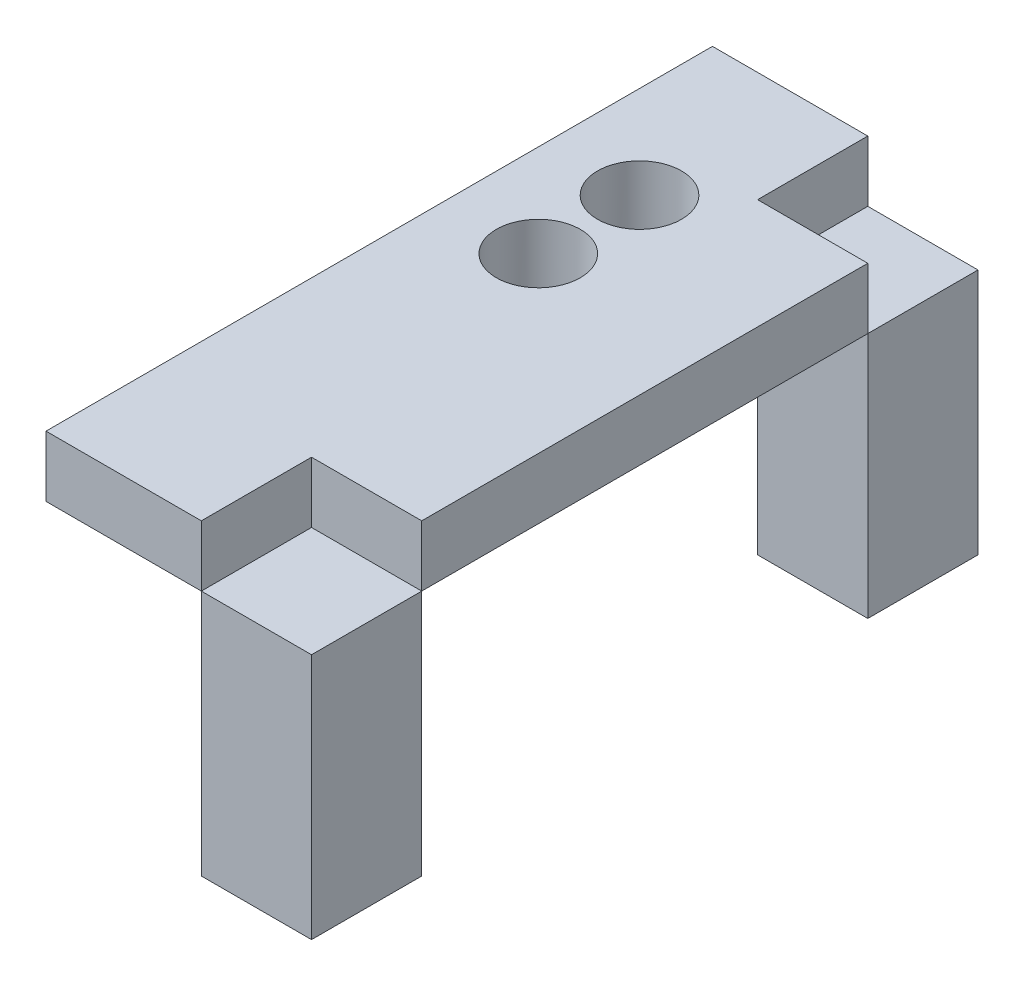
ISO-10303-21;
HEADER;
FILE_DESCRIPTION(('STEP AP214'),'2;1');
FILE_NAME('part.step','',(''),(''),'','','');
FILE_SCHEMA(('AUTOMOTIVE_DESIGN { 1 0 10303 214 1 1 1 1 }'));
ENDSEC;
DATA;
#1=APPLICATION_CONTEXT('core data for automotive mechanical design processes');
#2=APPLICATION_PROTOCOL_DEFINITION('international standard','automotive_design',2000,#1);
#3=PRODUCT_CONTEXT('',#1,'mechanical');
#4=PRODUCT('Part','Part','',(#3));
#5=PRODUCT_RELATED_PRODUCT_CATEGORY('part','',(#4));
#6=PRODUCT_DEFINITION_FORMATION('','',#4);
#7=PRODUCT_DEFINITION_CONTEXT('part definition',#1,'design');
#8=PRODUCT_DEFINITION('design','',#6,#7);
#9=PRODUCT_DEFINITION_SHAPE('','',#8);
#10=(LENGTH_UNIT() NAMED_UNIT(*) SI_UNIT(.MILLI.,.METRE.));
#11=(NAMED_UNIT(*) PLANE_ANGLE_UNIT() SI_UNIT($,.RADIAN.));
#12=(NAMED_UNIT(*) SI_UNIT($,.STERADIAN.) SOLID_ANGLE_UNIT());
#13=UNCERTAINTY_MEASURE_WITH_UNIT(LENGTH_MEASURE(1.E-05),#10,'distance_accuracy_value','');
#14=(GEOMETRIC_REPRESENTATION_CONTEXT(3) GLOBAL_UNCERTAINTY_ASSIGNED_CONTEXT((#13)) GLOBAL_UNIT_ASSIGNED_CONTEXT((#10,
#11,#12)) REPRESENTATION_CONTEXT('',''));
#15=CARTESIAN_POINT('',(0.,0.,0.));
#16=DIRECTION('',(0.,0.,1.));
#17=DIRECTION('',(1.,0.,0.));
#18=AXIS2_PLACEMENT_3D('',#15,#16,#17);
#19=CARTESIAN_POINT('',(-4.40000000014617,58.832258520887,7.35524959069381));
#20=DIRECTION('',(0.,0.,-1.));
#21=DIRECTION('',(0.,1.,0.));
#22=AXIS2_PLACEMENT_3D('',#19,#20,#21);
#23=PLANE('',#22);
#24=DIRECTION('',(-1.,0.,0.));
#25=VECTOR('',#24,1.);
#26=CARTESIAN_POINT('',(-4.40000000014592,24.6549999999976,7.35524959069391));
#27=LINE('',#26,#25);
#28=CARTESIAN_POINT('',(2.99999999999996,24.6549999999976,7.35524959069381));
#29=VERTEX_POINT('',#28);
#30=CARTESIAN_POINT('',(-4.40000000014617,24.6549999999976,7.35524959069381));
#31=VERTEX_POINT('',#30);
#32=EDGE_CURVE('E58',#29,#31,#27,.T.);
#33=ORIENTED_EDGE('',*,*,#32,.F.);
#34=DIRECTION('',(0.,-1.,0.));
#35=VECTOR('',#34,1.);
#36=CARTESIAN_POINT('',(2.99999999999996,58.832258520887,7.35524959069381));
#37=LINE('',#36,#35);
#38=CARTESIAN_POINT('',(2.99999999999996,21.7549999998925,7.35524959069392));
#39=VERTEX_POINT('',#38);
#40=EDGE_CURVE('E133',#29,#39,#37,.T.);
#41=ORIENTED_EDGE('',*,*,#40,.T.);
#42=DIRECTION('',(1.,0.,0.));
#43=VECTOR('',#42,1.);
#44=CARTESIAN_POINT('',(-4.40000000014617,21.7549999998925,7.35524959069392));
#45=LINE('',#44,#43);
#46=CARTESIAN_POINT('',(-4.40000000014617,21.7549999998925,7.35524959069392));
#47=VERTEX_POINT('',#46);
#48=EDGE_CURVE('E150',#47,#39,#45,.T.);
#49=ORIENTED_EDGE('',*,*,#48,.F.);
#50=DIRECTION('',(0.,-1.,0.));
#51=VECTOR('',#50,1.);
#52=CARTESIAN_POINT('',(-4.40000000014617,58.832258520887,7.35524959069381));
#53=LINE('',#52,#51);
#54=EDGE_CURVE('E119',#31,#47,#53,.T.);
#55=ORIENTED_EDGE('',*,*,#54,.F.);
#56=EDGE_LOOP('',(#33,#41,#49,#55));
#57=FACE_BOUND('',#56,.T.);
#58=ADVANCED_FACE('F50',(#57),#23,.T.);
#59=CARTESIAN_POINT('',(-4.40000000014639,58.8322585208871,39.1052495906938));
#60=DIRECTION('',(-1.,0.,0.));
#61=DIRECTION('',(0.,0.,1.));
#62=AXIS2_PLACEMENT_3D('',#59,#60,#61);
#63=PLANE('',#62);
#64=DIRECTION('',(0.,0.,1.));
#65=VECTOR('',#64,1.);
#66=CARTESIAN_POINT('',(-4.40000000014639,24.6549999999977,39.1052495906939));
#67=LINE('',#66,#65);
#68=CARTESIAN_POINT('',(-4.40000000014639,24.6549999999977,39.1052495906939));
#69=VERTEX_POINT('',#68);
#70=EDGE_CURVE('E96',#31,#69,#67,.T.);
#71=ORIENTED_EDGE('',*,*,#70,.F.);
#72=ORIENTED_EDGE('',*,*,#54,.T.);
#73=DIRECTION('',(0.,0.,-1.));
#74=VECTOR('',#73,1.);
#75=CARTESIAN_POINT('',(-4.40000000014639,21.7549999998926,39.1052495906939));
#76=LINE('',#75,#74);
#77=CARTESIAN_POINT('',(-4.40000000014639,21.7549999998926,39.1052495906939));
#78=VERTEX_POINT('',#77);
#79=EDGE_CURVE('E135',#78,#47,#76,.T.);
#80=ORIENTED_EDGE('',*,*,#79,.F.);
#81=DIRECTION('',(0.,-1.,0.));
#82=VECTOR('',#81,1.);
#83=CARTESIAN_POINT('',(-4.40000000014639,58.8322585208871,39.1052495906938));
#84=LINE('',#83,#82);
#85=EDGE_CURVE('E117',#69,#78,#84,.T.);
#86=ORIENTED_EDGE('',*,*,#85,.F.);
#87=EDGE_LOOP('',(#71,#72,#80,#86));
#88=FACE_BOUND('',#87,.T.);
#89=ADVANCED_FACE('F180',(#88),#63,.T.);
#90=CARTESIAN_POINT('',(2.99999999999996,58.8322585208871,39.1052495906938));
#91=DIRECTION('',(0.,0.,1.));
#92=DIRECTION('',(0.,-1.,0.));
#93=AXIS2_PLACEMENT_3D('',#90,#91,#92);
#94=PLANE('',#93);
#95=DIRECTION('',(1.,0.,0.));
#96=VECTOR('',#95,1.);
#97=CARTESIAN_POINT('',(3.0000000000002,24.6549999999977,39.1052495906939));
#98=LINE('',#97,#96);
#99=CARTESIAN_POINT('',(2.99999999999996,24.6549999999977,39.1052495906939));
#100=VERTEX_POINT('',#99);
#101=EDGE_CURVE('E92',#69,#100,#98,.T.);
#102=ORIENTED_EDGE('',*,*,#101,.F.);
#103=ORIENTED_EDGE('',*,*,#85,.T.);
#104=DIRECTION('',(-1.,0.,0.));
#105=VECTOR('',#104,1.);
#106=CARTESIAN_POINT('',(2.99999999999996,21.7549999998926,39.1052495906939));
#107=LINE('',#106,#105);
#108=CARTESIAN_POINT('',(2.99999999999996,21.7549999998926,39.1052495906939));
#109=VERTEX_POINT('',#108);
#110=EDGE_CURVE('E115',#109,#78,#107,.T.);
#111=ORIENTED_EDGE('',*,*,#110,.F.);
#112=DIRECTION('',(0.,-1.,0.));
#113=VECTOR('',#112,1.);
#114=CARTESIAN_POINT('',(2.99999999999996,58.8322585208871,39.1052495906938));
#115=LINE('',#114,#113);
#116=EDGE_CURVE('E108',#100,#109,#115,.T.);
#117=ORIENTED_EDGE('',*,*,#116,.F.);
#118=EDGE_LOOP('',(#102,#103,#111,#117));
#119=FACE_BOUND('',#118,.T.);
#120=ADVANCED_FACE('F113',(#119),#94,.T.);
#121=CARTESIAN_POINT('',(2.99999999999996,58.832258520887,33.8552495906938));
#122=DIRECTION('',(1.,0.,0.));
#123=DIRECTION('',(0.,0.,-1.));
#124=AXIS2_PLACEMENT_3D('',#121,#122,#123);
#125=PLANE('',#124);
#126=DIRECTION('',(0.,0.,-1.));
#127=VECTOR('',#126,1.);
#128=CARTESIAN_POINT('',(2.99999999999996,24.6549999999977,33.8552495906939));
#129=LINE('',#128,#127);
#130=CARTESIAN_POINT('',(2.99999999999996,24.6549999999977,33.8552495906939));
#131=VERTEX_POINT('',#130);
#132=EDGE_CURVE('E95',#100,#131,#129,.T.);
#133=ORIENTED_EDGE('',*,*,#132,.F.);
#134=ORIENTED_EDGE('',*,*,#116,.T.);
#135=DIRECTION('',(0.,0.,1.));
#136=VECTOR('',#135,1.);
#137=CARTESIAN_POINT('',(2.99999999999996,21.7549999998925,33.8552495906939));
#138=LINE('',#137,#136);
#139=CARTESIAN_POINT('',(2.99999999999996,21.7549999998925,33.8552495906939));
#140=VERTEX_POINT('',#139);
#141=EDGE_CURVE('E171',#140,#109,#138,.T.);
#142=ORIENTED_EDGE('',*,*,#141,.F.);
#143=DIRECTION('',(0.,-1.,0.));
#144=VECTOR('',#143,1.);
#145=CARTESIAN_POINT('',(2.99999999999996,58.832258520887,33.8552495906938));
#146=LINE('',#145,#144);
#147=EDGE_CURVE('E111',#131,#140,#146,.T.);
#148=ORIENTED_EDGE('',*,*,#147,.F.);
#149=EDGE_LOOP('',(#133,#134,#142,#148));
#150=FACE_BOUND('',#149,.T.);
#151=ADVANCED_FACE('F105',(#150),#125,.T.);
#152=CARTESIAN_POINT('',(8.24999999999982,58.832258520887,33.8552495906938));
#153=DIRECTION('',(0.,0.,1.));
#154=DIRECTION('',(0.,-1.,0.));
#155=AXIS2_PLACEMENT_3D('',#152,#153,#154);
#156=PLANE('',#155);
#157=DIRECTION('',(1.,0.,0.));
#158=VECTOR('',#157,1.);
#159=CARTESIAN_POINT('',(8.25000000000006,24.6549999999978,33.8552495906939));
#160=LINE('',#159,#158);
#161=CARTESIAN_POINT('',(8.24999999999982,24.6549999999978,33.8552495906939));
#162=VERTEX_POINT('',#161);
#163=EDGE_CURVE('E72',#131,#162,#160,.T.);
#164=ORIENTED_EDGE('',*,*,#163,.F.);
#165=ORIENTED_EDGE('',*,*,#147,.T.);
#166=DIRECTION('',(-1.,0.,0.));
#167=VECTOR('',#166,1.);
#168=CARTESIAN_POINT('',(8.24999999999982,21.7549999998925,33.8552495906939));
#169=LINE('',#168,#167);
#170=CARTESIAN_POINT('',(8.24999999999982,21.7549999998925,33.8552495906939));
#171=VERTEX_POINT('',#170);
#172=EDGE_CURVE('E168',#171,#140,#169,.T.);
#173=ORIENTED_EDGE('',*,*,#172,.F.);
#174=DIRECTION('',(0.,-1.,0.));
#175=VECTOR('',#174,1.);
#176=CARTESIAN_POINT('',(8.24999999999982,58.832258520887,33.8552495906938));
#177=LINE('',#176,#175);
#178=EDGE_CURVE('E121',#162,#171,#177,.T.);
#179=ORIENTED_EDGE('',*,*,#178,.F.);
#180=EDGE_LOOP('',(#164,#165,#173,#179));
#181=FACE_BOUND('',#180,.T.);
#182=ADVANCED_FACE('F212',(#181),#156,.T.);
#183=CARTESIAN_POINT('',(8.24999999999997,58.832258520887,12.6052495906938));
#184=DIRECTION('',(1.,0.,0.));
#185=DIRECTION('',(0.,0.,-1.));
#186=AXIS2_PLACEMENT_3D('',#183,#184,#185);
#187=PLANE('',#186);
#188=DIRECTION('',(0.,0.,-1.));
#189=VECTOR('',#188,1.);
#190=CARTESIAN_POINT('',(8.24999999999997,24.6549999999977,12.6052495906939));
#191=LINE('',#190,#189);
#192=CARTESIAN_POINT('',(8.24999999999997,24.6549999999977,12.6052495906939));
#193=VERTEX_POINT('',#192);
#194=EDGE_CURVE('E66',#162,#193,#191,.T.);
#195=ORIENTED_EDGE('',*,*,#194,.F.);
#196=ORIENTED_EDGE('',*,*,#178,.T.);
#197=DIRECTION('',(0.,0.,1.));
#198=VECTOR('',#197,1.);
#199=CARTESIAN_POINT('',(8.24999999999997,21.7549999998925,12.605249590694));
#200=LINE('',#199,#198);
#201=CARTESIAN_POINT('',(8.24999999999997,21.7549999998925,12.605249590694));
#202=VERTEX_POINT('',#201);
#203=EDGE_CURVE('E165',#202,#171,#200,.T.);
#204=ORIENTED_EDGE('',*,*,#203,.F.);
#205=DIRECTION('',(0.,-1.,0.));
#206=VECTOR('',#205,1.);
#207=CARTESIAN_POINT('',(8.24999999999997,58.832258520887,12.6052495906938));
#208=LINE('',#207,#206);
#209=EDGE_CURVE('E127',#193,#202,#208,.T.);
#210=ORIENTED_EDGE('',*,*,#209,.F.);
#211=EDGE_LOOP('',(#195,#196,#204,#210));
#212=FACE_BOUND('',#211,.T.);
#213=ADVANCED_FACE('F209',(#212),#187,.T.);
#214=CARTESIAN_POINT('',(2.99999999999996,58.832258520887,12.6052495906938));
#215=DIRECTION('',(0.,0.,-1.));
#216=DIRECTION('',(-1.,0.,0.));
#217=AXIS2_PLACEMENT_3D('',#214,#215,#216);
#218=PLANE('',#217);
#219=DIRECTION('',(-1.,0.,0.));
#220=VECTOR('',#219,1.);
#221=CARTESIAN_POINT('',(3.00000000000021,24.6549999999977,12.6052495906939));
#222=LINE('',#221,#220);
#223=CARTESIAN_POINT('',(2.99999999999996,24.6549999999976,12.6052495906939));
#224=VERTEX_POINT('',#223);
#225=EDGE_CURVE('E151',#193,#224,#222,.T.);
#226=ORIENTED_EDGE('',*,*,#225,.F.);
#227=ORIENTED_EDGE('',*,*,#209,.T.);
#228=DIRECTION('',(1.,0.,0.));
#229=VECTOR('',#228,1.);
#230=CARTESIAN_POINT('',(2.99999999999996,21.7549999998925,12.6052495906939));
#231=LINE('',#230,#229);
#232=CARTESIAN_POINT('',(2.99999999999996,21.7549999998925,12.6052495906939));
#233=VERTEX_POINT('',#232);
#234=EDGE_CURVE('E162',#233,#202,#231,.T.);
#235=ORIENTED_EDGE('',*,*,#234,.F.);
#236=DIRECTION('',(0.,-1.,0.));
#237=VECTOR('',#236,1.);
#238=CARTESIAN_POINT('',(2.99999999999996,58.832258520887,12.6052495906938));
#239=LINE('',#238,#237);
#240=EDGE_CURVE('E130',#224,#233,#239,.T.);
#241=ORIENTED_EDGE('',*,*,#240,.F.);
#242=EDGE_LOOP('',(#226,#227,#235,#241));
#243=FACE_BOUND('',#242,.T.);
#244=ADVANCED_FACE('F204',(#243),#218,.T.);
#245=CARTESIAN_POINT('',(2.99999999999996,58.832258520887,7.35524959069381));
#246=DIRECTION('',(1.,0.,0.));
#247=DIRECTION('',(0.,0.,-1.));
#248=AXIS2_PLACEMENT_3D('',#245,#246,#247);
#249=PLANE('',#248);
#250=DIRECTION('',(0.,0.,-1.));
#251=VECTOR('',#250,1.);
#252=CARTESIAN_POINT('',(2.99999999999996,24.6549999999976,7.35524959069391));
#253=LINE('',#252,#251);
#254=EDGE_CURVE('E12',#224,#29,#253,.T.);
#255=ORIENTED_EDGE('',*,*,#254,.F.);
#256=ORIENTED_EDGE('',*,*,#240,.T.);
#257=DIRECTION('',(0.,0.,1.));
#258=VECTOR('',#257,1.);
#259=CARTESIAN_POINT('',(2.99999999999996,21.7549999998925,7.35524959069392));
#260=LINE('',#259,#258);
#261=EDGE_CURVE('E159',#39,#233,#260,.T.);
#262=ORIENTED_EDGE('',*,*,#261,.F.);
#263=ORIENTED_EDGE('',*,*,#40,.F.);
#264=EDGE_LOOP('',(#255,#256,#262,#263));
#265=FACE_BOUND('',#264,.T.);
#266=ADVANCED_FACE('F202',(#265),#249,.T.);
#267=CARTESIAN_POINT('',(0.,21.7549999998924,0.));
#268=DIRECTION('',(0.,-1.,0.));
#269=DIRECTION('',(0.,0.,-1.));
#270=AXIS2_PLACEMENT_3D('',#267,#268,#269);
#271=PLANE('',#270);
#272=CARTESIAN_POINT('',(-3.44844931262299E-12,21.7549999998925,20.0516512176775));
#273=DIRECTION('',(0.,-1.,0.));
#274=DIRECTION('',(0.,0.,-1.));
#275=AXIS2_PLACEMENT_3D('',#272,#273,#274);
#276=CIRCLE('',#275,2.);
#277=CARTESIAN_POINT('',(-3.44844931262299E-12,21.7549999998925,18.0516512176775));
#278=VERTEX_POINT('',#277);
#279=EDGE_CURVE('E146',#278,#278,#276,.T.);
#280=ORIENTED_EDGE('',*,*,#279,.F.);
#281=EDGE_LOOP('',(#280));
#282=FACE_BOUND('',#281,.T.);
#283=CARTESIAN_POINT('',(-3.42434905588675E-12,21.7549999998925,15.2302495906822));
#284=DIRECTION('',(0.,-1.,0.));
#285=DIRECTION('',(0.,0.,-1.));
#286=AXIS2_PLACEMENT_3D('',#283,#284,#285);
#287=CIRCLE('',#286,2.);
#288=CARTESIAN_POINT('',(-3.42434905588675E-12,21.7549999998925,13.2302495906822));
#289=VERTEX_POINT('',#288);
#290=EDGE_CURVE('E138',#289,#289,#287,.T.);
#291=ORIENTED_EDGE('',*,*,#290,.F.);
#292=EDGE_LOOP('',(#291));
#293=FACE_BOUND('',#292,.T.);
#294=ORIENTED_EDGE('',*,*,#48,.T.);
#295=ORIENTED_EDGE('',*,*,#261,.T.);
#296=ORIENTED_EDGE('',*,*,#234,.T.);
#297=ORIENTED_EDGE('',*,*,#203,.T.);
#298=ORIENTED_EDGE('',*,*,#172,.T.);
#299=ORIENTED_EDGE('',*,*,#141,.T.);
#300=ORIENTED_EDGE('',*,*,#110,.T.);
#301=ORIENTED_EDGE('',*,*,#79,.T.);
#302=EDGE_LOOP('',(#294,#295,#296,#297,#298,#299,#300,#301));
#303=FACE_BOUND('',#302,.T.);
#304=ADVANCED_FACE('F187',(#282,#293,#303),#271,.T.);
#305=CARTESIAN_POINT('',(-18.0994560273808,24.6549999999975,12.2669979389023));
#306=DIRECTION('',(0.,-1.,0.));
#307=DIRECTION('',(-1.,0.,0.));
#308=AXIS2_PLACEMENT_3D('',#305,#306,#307);
#309=PLANE('',#308);
#310=CARTESIAN_POINT('',(-3.44685857805208E-12,24.6549999999977,20.0516512176775));
#311=DIRECTION('',(0.,-1.,0.));
#312=DIRECTION('',(1.,0.,0.));
#313=AXIS2_PLACEMENT_3D('',#310,#311,#312);
#314=CIRCLE('',#313,2.);
#315=CARTESIAN_POINT('',(1.99999999999655,24.6549999999977,20.0516512176775));
#316=VERTEX_POINT('',#315);
#317=EDGE_CURVE('E53',#316,#316,#314,.T.);
#318=ORIENTED_EDGE('',*,*,#317,.T.);
#319=EDGE_LOOP('',(#318));
#320=FACE_BOUND('',#319,.T.);
#321=CARTESIAN_POINT('',(-3.42275832131584E-12,24.6549999999976,15.2302495906822));
#322=DIRECTION('',(0.,-1.,0.));
#323=DIRECTION('',(1.,0.,0.));
#324=AXIS2_PLACEMENT_3D('',#321,#322,#323);
#325=CIRCLE('',#324,2.);
#326=CARTESIAN_POINT('',(1.99999999999658,24.6549999999977,15.2302495906822));
#327=VERTEX_POINT('',#326);
#328=EDGE_CURVE('E136',#327,#327,#325,.T.);
#329=ORIENTED_EDGE('',*,*,#328,.T.);
#330=EDGE_LOOP('',(#329));
#331=FACE_BOUND('',#330,.T.);
#332=ORIENTED_EDGE('',*,*,#32,.T.);
#333=ORIENTED_EDGE('',*,*,#70,.T.);
#334=ORIENTED_EDGE('',*,*,#101,.T.);
#335=ORIENTED_EDGE('',*,*,#132,.T.);
#336=ORIENTED_EDGE('',*,*,#163,.T.);
#337=ORIENTED_EDGE('',*,*,#194,.T.);
#338=ORIENTED_EDGE('',*,*,#225,.T.);
#339=ORIENTED_EDGE('',*,*,#254,.T.);
#340=EDGE_LOOP('',(#332,#333,#334,#335,#336,#337,#338,#339));
#341=FACE_BOUND('',#340,.T.);
#342=ADVANCED_FACE('F94',(#320,#331,#341),#309,.F.);
#343=CARTESIAN_POINT('',(-3.43079701619029E-12,9.99999999999993,15.2302495906822));
#344=DIRECTION('',(0.,1.,0.));
#345=DIRECTION('',(0.,0.,1.));
#346=AXIS2_PLACEMENT_3D('',#343,#344,#345);
#347=CYLINDRICAL_SURFACE('',#346,2.);
#348=ORIENTED_EDGE('',*,*,#290,.T.);
#349=EDGE_LOOP('',(#348));
#350=FACE_BOUND('',#349,.T.);
#351=ORIENTED_EDGE('',*,*,#328,.F.);
#352=EDGE_LOOP('',(#351));
#353=FACE_BOUND('',#352,.T.);
#354=ADVANCED_FACE('F236',(#350,#353),#347,.F.);
#355=CARTESIAN_POINT('',(-3.45489727292652E-12,9.99999999999995,20.0516512176776));
#356=DIRECTION('',(0.,1.,0.));
#357=DIRECTION('',(0.,0.,1.));
#358=AXIS2_PLACEMENT_3D('',#355,#356,#357);
#359=CYLINDRICAL_SURFACE('',#358,2.);
#360=ORIENTED_EDGE('',*,*,#279,.T.);
#361=EDGE_LOOP('',(#360));
#362=FACE_BOUND('',#361,.T.);
#363=ORIENTED_EDGE('',*,*,#317,.F.);
#364=EDGE_LOOP('',(#363));
#365=FACE_BOUND('',#364,.T.);
#366=ADVANCED_FACE('F240',(#362,#365),#359,.F.);
#367=CLOSED_SHELL('',(#58,#89,#120,#151,#182,#213,#244,#266,#304,#342,#354,#366));
#368=MANIFOLD_SOLID_BREP('B2',#367);
#369=CARTESIAN_POINT('',(0.,21.7549999998924,0.));
#370=DIRECTION('',(0.,-1.,0.));
#371=DIRECTION('',(0.,0.,-1.));
#372=AXIS2_PLACEMENT_3D('',#369,#370,#371);
#373=PLANE('',#372);
#374=DIRECTION('',(1.,0.,0.));
#375=VECTOR('',#374,1.);
#376=CARTESIAN_POINT('',(0.,21.7549999998925,7.35524959069393));
#377=LINE('',#376,#375);
#378=CARTESIAN_POINT('',(2.99999999999994,21.7549999998925,7.35524959069393));
#379=VERTEX_POINT('',#378);
#380=CARTESIAN_POINT('',(8.25,21.7549999998925,7.35524959069392));
#381=VERTEX_POINT('',#380);
#382=EDGE_CURVE('E403',#379,#381,#377,.T.);
#383=ORIENTED_EDGE('',*,*,#382,.F.);
#384=DIRECTION('',(0.,0.,1.));
#385=VECTOR('',#384,1.);
#386=CARTESIAN_POINT('',(2.99999999999994,21.7549999998924,0.));
#387=LINE('',#386,#385);
#388=CARTESIAN_POINT('',(2.99999999999994,21.7549999998925,12.6052495906939));
#389=VERTEX_POINT('',#388);
#390=EDGE_CURVE('E414',#379,#389,#387,.T.);
#391=ORIENTED_EDGE('',*,*,#390,.T.);
#392=DIRECTION('',(1.,0.,0.));
#393=VECTOR('',#392,1.);
#394=CARTESIAN_POINT('',(0.,21.7549999998925,12.6052495906939));
#395=LINE('',#394,#393);
#396=CARTESIAN_POINT('',(8.24999999999994,21.7549999998925,12.6052495906939));
#397=VERTEX_POINT('',#396);
#398=EDGE_CURVE('E406',#389,#397,#395,.T.);
#399=ORIENTED_EDGE('',*,*,#398,.T.);
#400=DIRECTION('',(0.,0.,1.));
#401=VECTOR('',#400,1.);
#402=CARTESIAN_POINT('',(8.25000000000005,21.7549999998924,0.));
#403=LINE('',#402,#401);
#404=EDGE_CURVE('E393',#381,#397,#403,.T.);
#405=ORIENTED_EDGE('',*,*,#404,.F.);
#406=EDGE_LOOP('',(#383,#391,#399,#405));
#407=FACE_BOUND('',#406,.T.);
#408=ADVANCED_FACE('F353',(#407),#373,.F.);
#409=CARTESIAN_POINT('',(2.99999999999994,2.57537879754118,0.));
#410=DIRECTION('',(-1.,0.,0.));
#411=DIRECTION('',(0.,0.,1.));
#412=AXIS2_PLACEMENT_3D('',#409,#410,#411);
#413=PLANE('',#412);
#414=DIRECTION('',(0.,1.,0.));
#415=VECTOR('',#414,1.);
#416=CARTESIAN_POINT('',(2.99999999999994,2.5753787975412,7.35524959069398));
#417=LINE('',#416,#415);
#418=CARTESIAN_POINT('',(3.,10.,7.35524959069397));
#419=VERTEX_POINT('',#418);
#420=EDGE_CURVE('E409',#419,#379,#417,.T.);
#421=ORIENTED_EDGE('',*,*,#420,.F.);
#422=DIRECTION('',(0.,0.,1.));
#423=VECTOR('',#422,1.);
#424=CARTESIAN_POINT('',(2.99999999999994,10.,0.));
#425=LINE('',#424,#423);
#426=CARTESIAN_POINT('',(2.99999999999994,10.,12.6052495906939));
#427=VERTEX_POINT('',#426);
#428=EDGE_CURVE('E397',#419,#427,#425,.T.);
#429=ORIENTED_EDGE('',*,*,#428,.T.);
#430=DIRECTION('',(0.,1.,0.));
#431=VECTOR('',#430,1.);
#432=CARTESIAN_POINT('',(2.99999999999994,2.57537879754121,12.605249590694));
#433=LINE('',#432,#431);
#434=EDGE_CURVE('E417',#427,#389,#433,.T.);
#435=ORIENTED_EDGE('',*,*,#434,.T.);
#436=ORIENTED_EDGE('',*,*,#390,.F.);
#437=EDGE_LOOP('',(#421,#429,#435,#436));
#438=FACE_BOUND('',#437,.T.);
#439=ADVANCED_FACE('F427',(#438),#413,.T.);
#440=CARTESIAN_POINT('',(0.,2.57537879754121,12.6052495906939));
#441=DIRECTION('',(0.,0.,1.));
#442=DIRECTION('',(1.,0.,0.));
#443=AXIS2_PLACEMENT_3D('',#440,#441,#442);
#444=PLANE('',#443);
#445=ORIENTED_EDGE('',*,*,#434,.F.);
#446=DIRECTION('',(1.,0.,0.));
#447=VECTOR('',#446,1.);
#448=CARTESIAN_POINT('',(0.,10.,12.6052495906939));
#449=LINE('',#448,#447);
#450=CARTESIAN_POINT('',(8.25,10.,12.605249590694));
#451=VERTEX_POINT('',#450);
#452=EDGE_CURVE('E420',#427,#451,#449,.T.);
#453=ORIENTED_EDGE('',*,*,#452,.T.);
#454=DIRECTION('',(0.,1.,0.));
#455=VECTOR('',#454,1.);
#456=CARTESIAN_POINT('',(8.24999999999994,2.57537879754121,12.605249590694));
#457=LINE('',#456,#455);
#458=EDGE_CURVE('E398',#451,#397,#457,.T.);
#459=ORIENTED_EDGE('',*,*,#458,.T.);
#460=ORIENTED_EDGE('',*,*,#398,.F.);
#461=EDGE_LOOP('',(#445,#453,#459,#460));
#462=FACE_BOUND('',#461,.T.);
#463=ADVANCED_FACE('F425',(#462),#444,.T.);
#464=CARTESIAN_POINT('',(8.25000000000005,2.57537879754118,0.));
#465=DIRECTION('',(-1.,0.,0.));
#466=DIRECTION('',(0.,0.,1.));
#467=AXIS2_PLACEMENT_3D('',#464,#465,#466);
#468=PLANE('',#467);
#469=DIRECTION('',(0.,0.,1.));
#470=VECTOR('',#469,1.);
#471=CARTESIAN_POINT('',(8.25000000000005,10.,0.));
#472=LINE('',#471,#470);
#473=CARTESIAN_POINT('',(8.25,10.,7.35524959069397));
#474=VERTEX_POINT('',#473);
#475=EDGE_CURVE('E357',#474,#451,#472,.T.);
#476=ORIENTED_EDGE('',*,*,#475,.F.);
#477=DIRECTION('',(0.,1.,0.));
#478=VECTOR('',#477,1.);
#479=CARTESIAN_POINT('',(8.25,2.5753787975412,7.35524959069398));
#480=LINE('',#479,#478);
#481=EDGE_CURVE('E390',#474,#381,#480,.T.);
#482=ORIENTED_EDGE('',*,*,#481,.T.);
#483=ORIENTED_EDGE('',*,*,#404,.T.);
#484=ORIENTED_EDGE('',*,*,#458,.F.);
#485=EDGE_LOOP('',(#476,#482,#483,#484));
#486=FACE_BOUND('',#485,.T.);
#487=ADVANCED_FACE('F392',(#486),#468,.F.);
#488=CARTESIAN_POINT('',(0.,2.5753787975412,7.35524959069399));
#489=DIRECTION('',(0.,0.,1.));
#490=DIRECTION('',(0.,-1.,0.));
#491=AXIS2_PLACEMENT_3D('',#488,#489,#490);
#492=PLANE('',#491);
#493=DIRECTION('',(1.,0.,0.));
#494=VECTOR('',#493,1.);
#495=CARTESIAN_POINT('',(0.,10.,7.35524959069397));
#496=LINE('',#495,#494);
#497=EDGE_CURVE('E48',#419,#474,#496,.T.);
#498=ORIENTED_EDGE('',*,*,#497,.F.);
#499=ORIENTED_EDGE('',*,*,#420,.T.);
#500=ORIENTED_EDGE('',*,*,#382,.T.);
#501=ORIENTED_EDGE('',*,*,#481,.F.);
#502=EDGE_LOOP('',(#498,#499,#500,#501));
#503=FACE_BOUND('',#502,.T.);
#504=ADVANCED_FACE('F355',(#503),#492,.F.);
#505=CARTESIAN_POINT('',(3.,10.,152.4));
#506=DIRECTION('',(0.,-1.,0.));
#507=DIRECTION('',(-1.,0.,0.));
#508=AXIS2_PLACEMENT_3D('',#505,#506,#507);
#509=PLANE('',#508);
#510=ORIENTED_EDGE('',*,*,#497,.T.);
#511=ORIENTED_EDGE('',*,*,#475,.T.);
#512=ORIENTED_EDGE('',*,*,#452,.F.);
#513=ORIENTED_EDGE('',*,*,#428,.F.);
#514=EDGE_LOOP('',(#510,#511,#512,#513));
#515=FACE_BOUND('',#514,.T.);
#516=ADVANCED_FACE('F426',(#515),#509,.T.);
#517=CLOSED_SHELL('',(#408,#439,#463,#487,#504,#516));
#518=MANIFOLD_SOLID_BREP('B6',#517);
#519=CARTESIAN_POINT('',(0.,21.7549999998924,0.));
#520=DIRECTION('',(0.,-1.,0.));
#521=DIRECTION('',(0.,0.,-1.));
#522=AXIS2_PLACEMENT_3D('',#519,#520,#521);
#523=PLANE('',#522);
#524=DIRECTION('',(0.,0.,1.));
#525=VECTOR('',#524,1.);
#526=CARTESIAN_POINT('',(2.99999999999994,21.7549999998924,0.));
#527=LINE('',#526,#525);
#528=CARTESIAN_POINT('',(2.99999999999994,21.7549999998925,33.8552495906939));
#529=VERTEX_POINT('',#528);
#530=CARTESIAN_POINT('',(2.99999999999994,21.7549999998926,39.1052495906939));
#531=VERTEX_POINT('',#530);
#532=EDGE_CURVE('E535',#529,#531,#527,.T.);
#533=ORIENTED_EDGE('',*,*,#532,.T.);
#534=DIRECTION('',(1.,0.,0.));
#535=VECTOR('',#534,1.);
#536=CARTESIAN_POINT('',(0.,21.7549999998926,39.1052495906939));
#537=LINE('',#536,#535);
#538=CARTESIAN_POINT('',(8.24999999999978,21.7549999998926,39.1052495906939));
#539=VERTEX_POINT('',#538);
#540=EDGE_CURVE('E546',#531,#539,#537,.T.);
#541=ORIENTED_EDGE('',*,*,#540,.T.);
#542=DIRECTION('',(0.,0.,1.));
#543=VECTOR('',#542,1.);
#544=CARTESIAN_POINT('',(8.25000000000005,21.7549999998924,0.));
#545=LINE('',#544,#543);
#546=CARTESIAN_POINT('',(8.24999999999982,21.7549999998925,33.8552495906939));
#547=VERTEX_POINT('',#546);
#548=EDGE_CURVE('E544',#547,#539,#545,.T.);
#549=ORIENTED_EDGE('',*,*,#548,.F.);
#550=DIRECTION('',(-1.,0.,0.));
#551=VECTOR('',#550,1.);
#552=CARTESIAN_POINT('',(0.,21.7549999998925,33.8552495906939));
#553=LINE('',#552,#551);
#554=EDGE_CURVE('E529',#547,#529,#553,.T.);
#555=ORIENTED_EDGE('',*,*,#554,.T.);
#556=EDGE_LOOP('',(#533,#541,#549,#555));
#557=FACE_BOUND('',#556,.T.);
#558=ADVANCED_FACE('F489',(#557),#523,.F.);
#559=CARTESIAN_POINT('',(0.,2.57537879754129,39.105249590694));
#560=DIRECTION('',(0.,0.,1.));
#561=DIRECTION('',(0.,-1.,0.));
#562=AXIS2_PLACEMENT_3D('',#559,#560,#561);
#563=PLANE('',#562);
#564=DIRECTION('',(0.,1.,0.));
#565=VECTOR('',#564,1.);
#566=CARTESIAN_POINT('',(2.99999999999994,2.57537879754129,39.105249590694));
#567=LINE('',#566,#565);
#568=CARTESIAN_POINT('',(3.,10.,39.105249590694));
#569=VERTEX_POINT('',#568);
#570=EDGE_CURVE('E537',#569,#531,#567,.T.);
#571=ORIENTED_EDGE('',*,*,#570,.F.);
#572=DIRECTION('',(1.,0.,0.));
#573=VECTOR('',#572,1.);
#574=CARTESIAN_POINT('',(0.,10.,39.1052495906939));
#575=LINE('',#574,#573);
#576=CARTESIAN_POINT('',(8.24999999999978,10.,39.1052495906939));
#577=VERTEX_POINT('',#576);
#578=EDGE_CURVE('E531',#569,#577,#575,.T.);
#579=ORIENTED_EDGE('',*,*,#578,.T.);
#580=DIRECTION('',(0.,1.,0.));
#581=VECTOR('',#580,1.);
#582=CARTESIAN_POINT('',(8.24999999999978,2.57537879754129,39.105249590694));
#583=LINE('',#582,#581);
#584=EDGE_CURVE('E552',#577,#539,#583,.T.);
#585=ORIENTED_EDGE('',*,*,#584,.T.);
#586=ORIENTED_EDGE('',*,*,#540,.F.);
#587=EDGE_LOOP('',(#571,#579,#585,#586));
#588=FACE_BOUND('',#587,.T.);
#589=ADVANCED_FACE('F563',(#588),#563,.T.);
#590=CARTESIAN_POINT('',(8.25000000000005,2.57537879754118,0.));
#591=DIRECTION('',(-1.,0.,0.));
#592=DIRECTION('',(0.,0.,1.));
#593=AXIS2_PLACEMENT_3D('',#590,#591,#592);
#594=PLANE('',#593);
#595=DIRECTION('',(0.,0.,1.));
#596=VECTOR('',#595,1.);
#597=CARTESIAN_POINT('',(8.25000000000005,10.,0.));
#598=LINE('',#597,#596);
#599=CARTESIAN_POINT('',(8.25,10.,33.855249590694));
#600=VERTEX_POINT('',#599);
#601=EDGE_CURVE('E556',#600,#577,#598,.T.);
#602=ORIENTED_EDGE('',*,*,#601,.F.);
#603=DIRECTION('',(0.,1.,0.));
#604=VECTOR('',#603,1.);
#605=CARTESIAN_POINT('',(8.24999999999982,2.57537879754128,33.855249590694));
#606=LINE('',#605,#604);
#607=EDGE_CURVE('E532',#600,#547,#606,.T.);
#608=ORIENTED_EDGE('',*,*,#607,.T.);
#609=ORIENTED_EDGE('',*,*,#548,.T.);
#610=ORIENTED_EDGE('',*,*,#584,.F.);
#611=EDGE_LOOP('',(#602,#608,#609,#610));
#612=FACE_BOUND('',#611,.T.);
#613=ADVANCED_FACE('F561',(#612),#594,.F.);
#614=CARTESIAN_POINT('',(0.,2.57537879754128,33.855249590694));
#615=DIRECTION('',(0.,0.,-1.));
#616=DIRECTION('',(0.,1.,0.));
#617=AXIS2_PLACEMENT_3D('',#614,#615,#616);
#618=PLANE('',#617);
#619=ORIENTED_EDGE('',*,*,#607,.F.);
#620=DIRECTION('',(-1.,0.,0.));
#621=VECTOR('',#620,1.);
#622=CARTESIAN_POINT('',(0.,10.,33.855249590694));
#623=LINE('',#622,#621);
#624=CARTESIAN_POINT('',(3.,10.,33.855249590694));
#625=VERTEX_POINT('',#624);
#626=EDGE_CURVE('E497',#600,#625,#623,.T.);
#627=ORIENTED_EDGE('',*,*,#626,.T.);
#628=DIRECTION('',(0.,1.,0.));
#629=VECTOR('',#628,1.);
#630=CARTESIAN_POINT('',(2.99999999999994,2.57537879754128,33.855249590694));
#631=LINE('',#630,#629);
#632=EDGE_CURVE('E525',#625,#529,#631,.T.);
#633=ORIENTED_EDGE('',*,*,#632,.T.);
#634=ORIENTED_EDGE('',*,*,#554,.F.);
#635=EDGE_LOOP('',(#619,#627,#633,#634));
#636=FACE_BOUND('',#635,.T.);
#637=ADVANCED_FACE('F527',(#636),#618,.T.);
#638=CARTESIAN_POINT('',(2.99999999999994,2.57537879754118,0.));
#639=DIRECTION('',(-1.,0.,0.));
#640=DIRECTION('',(0.,0.,1.));
#641=AXIS2_PLACEMENT_3D('',#638,#639,#640);
#642=PLANE('',#641);
#643=ORIENTED_EDGE('',*,*,#632,.F.);
#644=DIRECTION('',(0.,0.,1.));
#645=VECTOR('',#644,1.);
#646=CARTESIAN_POINT('',(2.99999999999994,10.,0.));
#647=LINE('',#646,#645);
#648=EDGE_CURVE('E351',#625,#569,#647,.T.);
#649=ORIENTED_EDGE('',*,*,#648,.T.);
#650=ORIENTED_EDGE('',*,*,#570,.T.);
#651=ORIENTED_EDGE('',*,*,#532,.F.);
#652=EDGE_LOOP('',(#643,#649,#650,#651));
#653=FACE_BOUND('',#652,.T.);
#654=ADVANCED_FACE('F491',(#653),#642,.T.);
#655=CARTESIAN_POINT('',(3.,10.,152.4));
#656=DIRECTION('',(0.,-1.,0.));
#657=DIRECTION('',(-1.,0.,0.));
#658=AXIS2_PLACEMENT_3D('',#655,#656,#657);
#659=PLANE('',#658);
#660=ORIENTED_EDGE('',*,*,#601,.T.);
#661=ORIENTED_EDGE('',*,*,#578,.F.);
#662=ORIENTED_EDGE('',*,*,#648,.F.);
#663=ORIENTED_EDGE('',*,*,#626,.F.);
#664=EDGE_LOOP('',(#660,#661,#662,#663));
#665=FACE_BOUND('',#664,.T.);
#666=ADVANCED_FACE('F559',(#665),#659,.T.);
#667=CLOSED_SHELL('',(#558,#589,#613,#637,#654,#666));
#668=MANIFOLD_SOLID_BREP('B42',#667);
#669=ADVANCED_BREP_SHAPE_REPRESENTATION('',(#18,#368,#518,#668),#14);
#670=SHAPE_DEFINITION_REPRESENTATION(#9,#669);
ENDSEC;
END-ISO-10303-21;
